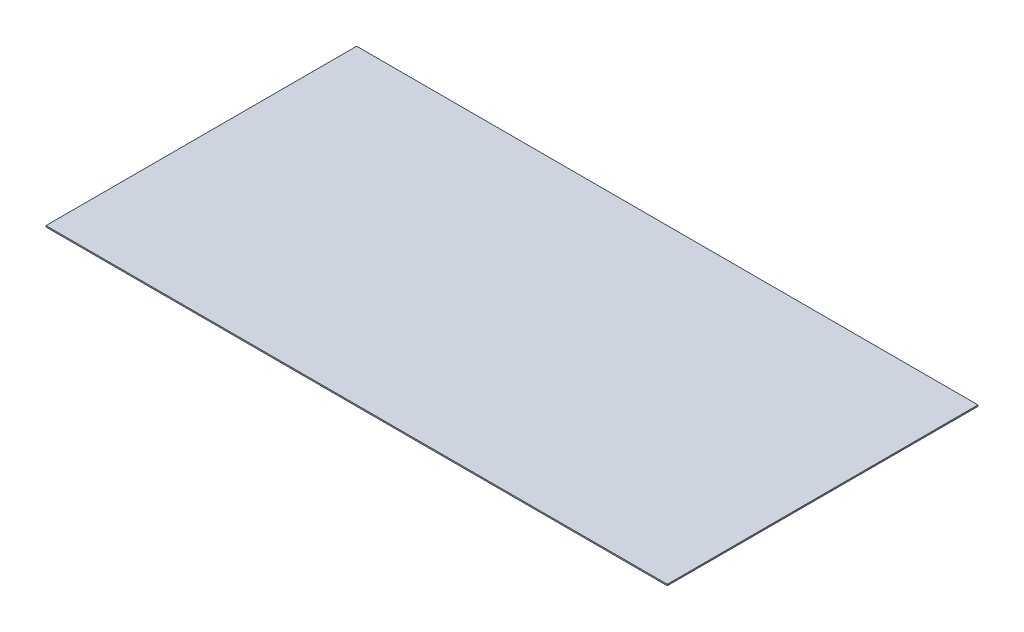
ISO-10303-21;
HEADER;
FILE_DESCRIPTION(('STEP AP214'),'2;1');
FILE_NAME('part.step','',(''),(''),'','','');
FILE_SCHEMA(('AUTOMOTIVE_DESIGN { 1 0 10303 214 1 1 1 1 }'));
ENDSEC;
DATA;
#1=APPLICATION_CONTEXT('core data for automotive mechanical design processes');
#2=APPLICATION_PROTOCOL_DEFINITION('international standard','automotive_design',2000,#1);
#3=PRODUCT_CONTEXT('',#1,'mechanical');
#4=PRODUCT('Part','Part','',(#3));
#5=PRODUCT_RELATED_PRODUCT_CATEGORY('part','',(#4));
#6=PRODUCT_DEFINITION_FORMATION('','',#4);
#7=PRODUCT_DEFINITION_CONTEXT('part definition',#1,'design');
#8=PRODUCT_DEFINITION('design','',#6,#7);
#9=PRODUCT_DEFINITION_SHAPE('','',#8);
#10=(LENGTH_UNIT() NAMED_UNIT(*) SI_UNIT(.MILLI.,.METRE.));
#11=(NAMED_UNIT(*) PLANE_ANGLE_UNIT() SI_UNIT($,.RADIAN.));
#12=(NAMED_UNIT(*) SI_UNIT($,.STERADIAN.) SOLID_ANGLE_UNIT());
#13=UNCERTAINTY_MEASURE_WITH_UNIT(LENGTH_MEASURE(1.E-05),#10,'distance_accuracy_value','');
#14=(GEOMETRIC_REPRESENTATION_CONTEXT(3) GLOBAL_UNCERTAINTY_ASSIGNED_CONTEXT((#13)) GLOBAL_UNIT_ASSIGNED_CONTEXT((#10,
#11,#12)) REPRESENTATION_CONTEXT('',''));
#15=CARTESIAN_POINT('',(0.,0.,0.));
#16=DIRECTION('',(0.,0.,1.));
#17=DIRECTION('',(1.,0.,0.));
#18=AXIS2_PLACEMENT_3D('',#15,#16,#17);
#19=CARTESIAN_POINT('',(0.,2.54,0.));
#20=DIRECTION('',(0.,1.,0.));
#21=DIRECTION('',(0.,0.,1.));
#22=AXIS2_PLACEMENT_3D('',#19,#20,#21);
#23=PLANE('',#22);
#24=DIRECTION('',(0.,0.,1.));
#25=VECTOR('',#24,1.);
#26=CARTESIAN_POINT('',(609.6,2.54,304.8));
#27=LINE('',#26,#25);
#28=CARTESIAN_POINT('',(609.6,2.54,304.8));
#29=VERTEX_POINT('',#28);
#30=CARTESIAN_POINT('',(609.6,2.54,-304.8));
#31=VERTEX_POINT('',#30);
#32=EDGE_CURVE('E54',#29,#31,#27,.F.);
#33=ORIENTED_EDGE('',*,*,#32,.T.);
#34=DIRECTION('',(1.,0.,0.));
#35=VECTOR('',#34,1.);
#36=CARTESIAN_POINT('',(609.6,2.54,-304.8));
#37=LINE('',#36,#35);
#38=CARTESIAN_POINT('',(-609.6,2.54,-304.8));
#39=VERTEX_POINT('',#38);
#40=EDGE_CURVE('E75',#31,#39,#37,.F.);
#41=ORIENTED_EDGE('',*,*,#40,.T.);
#42=DIRECTION('',(0.,0.,-1.));
#43=VECTOR('',#42,1.);
#44=CARTESIAN_POINT('',(-609.6,2.54,304.8));
#45=LINE('',#44,#43);
#46=CARTESIAN_POINT('',(-609.6,2.54,304.8));
#47=VERTEX_POINT('',#46);
#48=EDGE_CURVE('E57',#39,#47,#45,.F.);
#49=ORIENTED_EDGE('',*,*,#48,.T.);
#50=DIRECTION('',(-1.,0.,0.));
#51=VECTOR('',#50,1.);
#52=CARTESIAN_POINT('',(609.6,2.54,304.8));
#53=LINE('',#52,#51);
#54=EDGE_CURVE('E19',#47,#29,#53,.F.);
#55=ORIENTED_EDGE('',*,*,#54,.T.);
#56=EDGE_LOOP('',(#33,#41,#49,#55));
#57=FACE_BOUND('',#56,.T.);
#58=ADVANCED_FACE('F16',(#57),#23,.T.);
#59=CARTESIAN_POINT('',(609.6,2.54,304.8));
#60=DIRECTION('',(0.,0.,-1.));
#61=DIRECTION('',(-1.,0.,0.));
#62=AXIS2_PLACEMENT_3D('',#59,#60,#61);
#63=PLANE('',#62);
#64=DIRECTION('',(0.,1.,0.));
#65=VECTOR('',#64,1.);
#66=CARTESIAN_POINT('',(609.6,2.54,304.8));
#67=LINE('',#66,#65);
#68=CARTESIAN_POINT('',(609.6,0.,304.8));
#69=VERTEX_POINT('',#68);
#70=EDGE_CURVE('E62',#69,#29,#67,.T.);
#71=ORIENTED_EDGE('',*,*,#70,.T.);
#72=ORIENTED_EDGE('',*,*,#54,.F.);
#73=DIRECTION('',(0.,1.,0.));
#74=VECTOR('',#73,1.);
#75=CARTESIAN_POINT('',(-609.6,2.54,304.8));
#76=LINE('',#75,#74);
#77=CARTESIAN_POINT('',(-609.6,0.,304.8));
#78=VERTEX_POINT('',#77);
#79=EDGE_CURVE('E79',#47,#78,#76,.F.);
#80=ORIENTED_EDGE('',*,*,#79,.T.);
#81=DIRECTION('',(1.,0.,0.));
#82=VECTOR('',#81,1.);
#83=CARTESIAN_POINT('',(0.,0.,304.8));
#84=LINE('',#83,#82);
#85=EDGE_CURVE('E72',#78,#69,#84,.T.);
#86=ORIENTED_EDGE('',*,*,#85,.T.);
#87=EDGE_LOOP('',(#71,#72,#80,#86));
#88=FACE_BOUND('',#87,.T.);
#89=ADVANCED_FACE('F71',(#88),#63,.F.);
#90=CARTESIAN_POINT('',(609.6,2.54,304.8));
#91=DIRECTION('',(-1.,0.,0.));
#92=DIRECTION('',(0.,0.,1.));
#93=AXIS2_PLACEMENT_3D('',#90,#91,#92);
#94=PLANE('',#93);
#95=DIRECTION('',(0.,1.,0.));
#96=VECTOR('',#95,1.);
#97=CARTESIAN_POINT('',(609.6,2.54,-304.8));
#98=LINE('',#97,#96);
#99=CARTESIAN_POINT('',(609.6,0.,-304.8));
#100=VERTEX_POINT('',#99);
#101=EDGE_CURVE('E68',#100,#31,#98,.T.);
#102=ORIENTED_EDGE('',*,*,#101,.T.);
#103=ORIENTED_EDGE('',*,*,#32,.F.);
#104=ORIENTED_EDGE('',*,*,#70,.F.);
#105=DIRECTION('',(0.,0.,1.));
#106=VECTOR('',#105,1.);
#107=CARTESIAN_POINT('',(609.6,0.,0.));
#108=LINE('',#107,#106);
#109=EDGE_CURVE('E82',#69,#100,#108,.F.);
#110=ORIENTED_EDGE('',*,*,#109,.T.);
#111=EDGE_LOOP('',(#102,#103,#104,#110));
#112=FACE_BOUND('',#111,.T.);
#113=ADVANCED_FACE('F65',(#112),#94,.F.);
#114=CARTESIAN_POINT('',(609.6,2.54,-304.8));
#115=DIRECTION('',(0.,0.,1.));
#116=DIRECTION('',(1.,0.,0.));
#117=AXIS2_PLACEMENT_3D('',#114,#115,#116);
#118=PLANE('',#117);
#119=DIRECTION('',(0.,1.,0.));
#120=VECTOR('',#119,1.);
#121=CARTESIAN_POINT('',(-609.6,2.54,-304.8));
#122=LINE('',#121,#120);
#123=CARTESIAN_POINT('',(-609.6,0.,-304.8));
#124=VERTEX_POINT('',#123);
#125=EDGE_CURVE('E33',#124,#39,#122,.T.);
#126=ORIENTED_EDGE('',*,*,#125,.T.);
#127=ORIENTED_EDGE('',*,*,#40,.F.);
#128=ORIENTED_EDGE('',*,*,#101,.F.);
#129=DIRECTION('',(1.,0.,0.));
#130=VECTOR('',#129,1.);
#131=CARTESIAN_POINT('',(0.,0.,-304.8));
#132=LINE('',#131,#130);
#133=EDGE_CURVE('E25',#100,#124,#132,.F.);
#134=ORIENTED_EDGE('',*,*,#133,.T.);
#135=EDGE_LOOP('',(#126,#127,#128,#134));
#136=FACE_BOUND('',#135,.T.);
#137=ADVANCED_FACE('F87',(#136),#118,.F.);
#138=CARTESIAN_POINT('',(-609.6,2.54,304.8));
#139=DIRECTION('',(1.,0.,0.));
#140=DIRECTION('',(0.,0.,-1.));
#141=AXIS2_PLACEMENT_3D('',#138,#139,#140);
#142=PLANE('',#141);
#143=ORIENTED_EDGE('',*,*,#79,.F.);
#144=ORIENTED_EDGE('',*,*,#48,.F.);
#145=ORIENTED_EDGE('',*,*,#125,.F.);
#146=DIRECTION('',(0.,0.,1.));
#147=VECTOR('',#146,1.);
#148=CARTESIAN_POINT('',(-609.6,0.,0.));
#149=LINE('',#148,#147);
#150=EDGE_CURVE('E11',#124,#78,#149,.T.);
#151=ORIENTED_EDGE('',*,*,#150,.T.);
#152=EDGE_LOOP('',(#143,#144,#145,#151));
#153=FACE_BOUND('',#152,.T.);
#154=ADVANCED_FACE('F90',(#153),#142,.F.);
#155=CARTESIAN_POINT('',(0.,0.,0.));
#156=DIRECTION('',(0.,1.,0.));
#157=DIRECTION('',(0.,0.,1.));
#158=AXIS2_PLACEMENT_3D('',#155,#156,#157);
#159=PLANE('',#158);
#160=ORIENTED_EDGE('',*,*,#133,.F.);
#161=ORIENTED_EDGE('',*,*,#109,.F.);
#162=ORIENTED_EDGE('',*,*,#85,.F.);
#163=ORIENTED_EDGE('',*,*,#150,.F.);
#164=EDGE_LOOP('',(#160,#161,#162,#163));
#165=FACE_BOUND('',#164,.T.);
#166=ADVANCED_FACE('F89',(#165),#159,.F.);
#167=CLOSED_SHELL('',(#58,#89,#113,#137,#154,#166));
#168=MANIFOLD_SOLID_BREP('B1',#167);
#169=ADVANCED_BREP_SHAPE_REPRESENTATION('',(#18,#168),#14);
#170=SHAPE_DEFINITION_REPRESENTATION(#9,#169);
ENDSEC;
END-ISO-10303-21;
